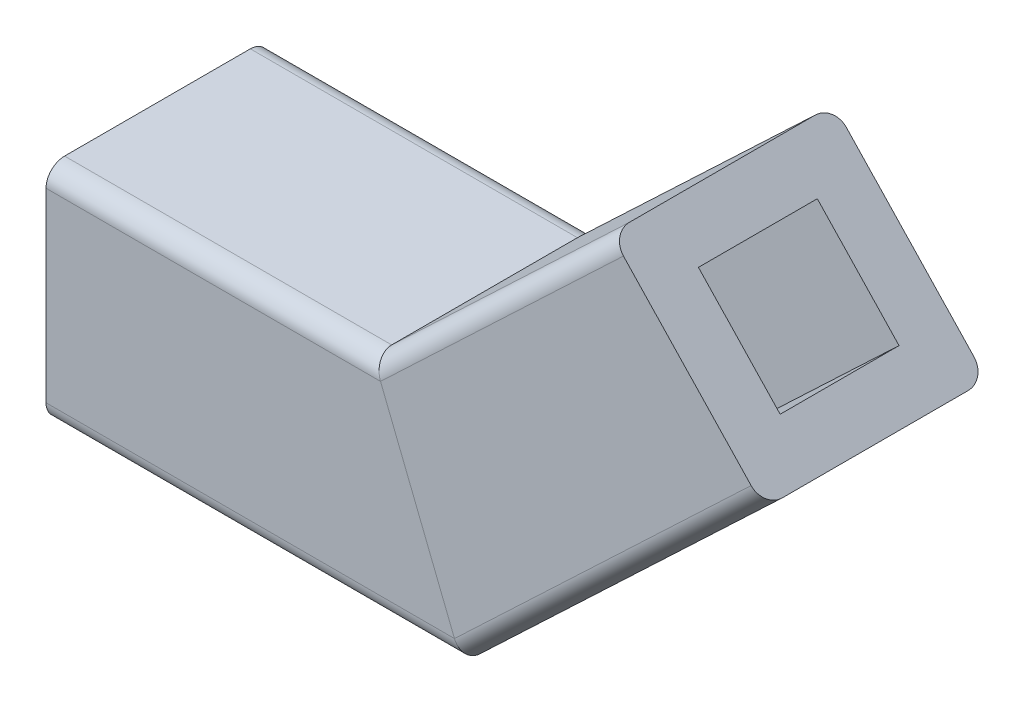
ISO-10303-21;
HEADER;
FILE_DESCRIPTION(('STEP AP214'),'2;1');
FILE_NAME('part.step','',(''),(''),'','','');
FILE_SCHEMA(('AUTOMOTIVE_DESIGN { 1 0 10303 214 1 1 1 1 }'));
ENDSEC;
DATA;
#1=APPLICATION_CONTEXT('core data for automotive mechanical design processes');
#2=APPLICATION_PROTOCOL_DEFINITION('international standard','automotive_design',2000,#1);
#3=PRODUCT_CONTEXT('',#1,'mechanical');
#4=PRODUCT('Part','Part','',(#3));
#5=PRODUCT_RELATED_PRODUCT_CATEGORY('part','',(#4));
#6=PRODUCT_DEFINITION_FORMATION('','',#4);
#7=PRODUCT_DEFINITION_CONTEXT('part definition',#1,'design');
#8=PRODUCT_DEFINITION('design','',#6,#7);
#9=PRODUCT_DEFINITION_SHAPE('','',#8);
#10=(LENGTH_UNIT() NAMED_UNIT(*) SI_UNIT(.MILLI.,.METRE.));
#11=(NAMED_UNIT(*) PLANE_ANGLE_UNIT() SI_UNIT($,.RADIAN.));
#12=(NAMED_UNIT(*) SI_UNIT($,.STERADIAN.) SOLID_ANGLE_UNIT());
#13=UNCERTAINTY_MEASURE_WITH_UNIT(LENGTH_MEASURE(1.E-05),#10,'distance_accuracy_value','');
#14=(GEOMETRIC_REPRESENTATION_CONTEXT(3) GLOBAL_UNCERTAINTY_ASSIGNED_CONTEXT((#13)) GLOBAL_UNIT_ASSIGNED_CONTEXT((#10,
#11,#12)) REPRESENTATION_CONTEXT('',''));
#15=CARTESIAN_POINT('',(0.,0.,0.));
#16=DIRECTION('',(0.,0.,1.));
#17=DIRECTION('',(1.,0.,0.));
#18=AXIS2_PLACEMENT_3D('',#15,#16,#17);
#19=CARTESIAN_POINT('',(11.0353685179918,-3.15088234105784,-3.));
#20=DIRECTION('',(0.,0.,-1.));
#21=DIRECTION('',(-1.,0.,0.));
#22=AXIS2_PLACEMENT_3D('',#19,#20,#21);
#23=PLANE('',#22);
#24=DIRECTION('',(-0.687467850210673,0.726214813210743,0.));
#25=VECTOR('',#24,1.);
#26=CARTESIAN_POINT('',(19.3245516827395,4.6960340624745,-3.));
#27=LINE('',#26,#25);
#28=CARTESIAN_POINT('',(18.9808177576341,5.05914146907988,-3.));
#29=VERTEX_POINT('',#28);
#30=CARTESIAN_POINT('',(15.5434785065807,8.69021553513359,-3.));
#31=VERTEX_POINT('',#30);
#32=EDGE_CURVE('E240',#29,#31,#27,.T.);
#33=ORIENTED_EDGE('',*,*,#32,.F.);
#34=DIRECTION('',(0.726214813210743,0.687467850210674,0.));
#35=VECTOR('',#34,1.);
#36=CARTESIAN_POINT('',(10.6916345928865,-2.78777493445247,-3.));
#37=LINE('',#36,#35);
#38=CARTESIAN_POINT('',(10.9956290563455,-2.5,-3.));
#39=VERTEX_POINT('',#38);
#40=EDGE_CURVE('E277',#29,#39,#37,.F.);
#41=ORIENTED_EDGE('',*,*,#40,.T.);
#42=DIRECTION('',(0.369989990938442,-0.929035740219595,0.));
#43=VECTOR('',#42,1.);
#44=CARTESIAN_POINT('',(9.66227584136973,0.848017031237252,-3.));
#45=LINE('',#44,#43);
#46=CARTESIAN_POINT('',(9.00437094365447,2.5,-3.));
#47=VERTEX_POINT('',#46);
#48=EDGE_CURVE('E256',#47,#39,#45,.T.);
#49=ORIENTED_EDGE('',*,*,#48,.F.);
#50=DIRECTION('',(0.726214813210743,0.687467850210674,0.));
#51=VECTOR('',#50,1.);
#52=CARTESIAN_POINT('',(7.25429534183311,0.843299131601245,-3.));
#53=LINE('',#52,#51);
#54=EDGE_CURVE('E274',#47,#31,#53,.T.);
#55=ORIENTED_EDGE('',*,*,#54,.T.);
#56=EDGE_LOOP('',(#33,#41,#49,#55));
#57=FACE_BOUND('',#56,.T.);
#58=ADVANCED_FACE('F41',(#57),#23,.T.);
#59=CARTESIAN_POINT('',(6.91056141672778,1.20640653820662,-3.));
#60=DIRECTION('',(-0.687467850210674,0.726214813210743,0.));
#61=DIRECTION('',(-0.726214813210743,-0.687467850210674,0.));
#62=AXIS2_PLACEMENT_3D('',#59,#60,#61);
#63=PLANE('',#62);
#64=DIRECTION('',(0.,0.,1.));
#65=VECTOR('',#64,1.);
#66=CARTESIAN_POINT('',(15.1997445814754,9.05332294173896,-3.));
#67=LINE('',#66,#65);
#68=CARTESIAN_POINT('',(15.1997445814754,9.05332294173896,-2.5));
#69=VERTEX_POINT('',#68);
#70=CARTESIAN_POINT('',(15.1997445814754,9.05332294173896,2.5));
#71=VERTEX_POINT('',#70);
#72=EDGE_CURVE('E237',#69,#71,#67,.T.);
#73=ORIENTED_EDGE('',*,*,#72,.F.);
#74=DIRECTION('',(0.726214813210743,0.687467850210674,0.));
#75=VECTOR('',#74,1.);
#76=CARTESIAN_POINT('',(6.91056141672778,1.20640653820662,-2.5));
#77=LINE('',#76,#75);
#78=CARTESIAN_POINT('',(8.80524513238537,3.,-2.5));
#79=VERTEX_POINT('',#78);
#80=EDGE_CURVE('E298',#69,#79,#77,.F.);
#81=ORIENTED_EDGE('',*,*,#80,.T.);
#82=DIRECTION('',(0.,0.,-1.));
#83=VECTOR('',#82,1.);
#84=CARTESIAN_POINT('',(8.80524513238537,3.,-3.));
#85=LINE('',#84,#83);
#86=CARTESIAN_POINT('',(8.80524513238537,3.,2.5));
#87=VERTEX_POINT('',#86);
#88=EDGE_CURVE('E248',#87,#79,#85,.T.);
#89=ORIENTED_EDGE('',*,*,#88,.F.);
#90=DIRECTION('',(0.726214813210743,0.687467850210674,0.));
#91=VECTOR('',#90,1.);
#92=CARTESIAN_POINT('',(6.91056141672778,1.20640653820661,2.5));
#93=LINE('',#92,#91);
#94=EDGE_CURVE('E295',#87,#71,#93,.T.);
#95=ORIENTED_EDGE('',*,*,#94,.T.);
#96=EDGE_LOOP('',(#73,#81,#89,#95));
#97=FACE_BOUND('',#96,.T.);
#98=ADVANCED_FACE('F345',(#97),#63,.T.);
#99=CARTESIAN_POINT('',(11.0353685179918,-3.15088234105785,3.));
#100=DIRECTION('',(0.,0.,1.));
#101=DIRECTION('',(1.,0.,0.));
#102=AXIS2_PLACEMENT_3D('',#99,#100,#101);
#103=PLANE('',#102);
#104=DIRECTION('',(-0.369989990938442,0.929035740219595,0.));
#105=VECTOR('',#104,1.);
#106=CARTESIAN_POINT('',(9.66227584136973,0.848017031237251,3.));
#107=LINE('',#106,#105);
#108=CARTESIAN_POINT('',(10.9956290563455,-2.5,3.));
#109=VERTEX_POINT('',#108);
#110=CARTESIAN_POINT('',(9.00437094365447,2.5,3.));
#111=VERTEX_POINT('',#110);
#112=EDGE_CURVE('E251',#109,#111,#107,.T.);
#113=ORIENTED_EDGE('',*,*,#112,.F.);
#114=DIRECTION('',(0.726214813210743,0.687467850210674,0.));
#115=VECTOR('',#114,1.);
#116=CARTESIAN_POINT('',(10.6916345928865,-2.78777493445247,3.));
#117=LINE('',#116,#115);
#118=CARTESIAN_POINT('',(18.9808177576341,5.05914146907987,3.));
#119=VERTEX_POINT('',#118);
#120=EDGE_CURVE('E305',#109,#119,#117,.T.);
#121=ORIENTED_EDGE('',*,*,#120,.T.);
#122=DIRECTION('',(0.687467850210673,-0.726214813210743,0.));
#123=VECTOR('',#122,1.);
#124=CARTESIAN_POINT('',(19.3245516827395,4.6960340624745,3.));
#125=LINE('',#124,#123);
#126=CARTESIAN_POINT('',(15.5434785065808,8.69021553513359,3.));
#127=VERTEX_POINT('',#126);
#128=EDGE_CURVE('E241',#127,#119,#125,.T.);
#129=ORIENTED_EDGE('',*,*,#128,.F.);
#130=DIRECTION('',(0.726214813210743,0.687467850210674,0.));
#131=VECTOR('',#130,1.);
#132=CARTESIAN_POINT('',(7.25429534183311,0.843299131601243,3.));
#133=LINE('',#132,#131);
#134=EDGE_CURVE('E58',#127,#111,#133,.F.);
#135=ORIENTED_EDGE('',*,*,#134,.T.);
#136=EDGE_LOOP('',(#113,#121,#129,#135));
#137=FACE_BOUND('',#136,.T.);
#138=ADVANCED_FACE('F338',(#137),#103,.T.);
#139=CARTESIAN_POINT('',(11.0353685179918,-3.15088234105784,-3.));
#140=DIRECTION('',(0.687467850210674,-0.726214813210743,0.));
#141=DIRECTION('',(0.726214813210743,0.687467850210674,0.));
#142=AXIS2_PLACEMENT_3D('',#139,#140,#141);
#143=PLANE('',#142);
#144=DIRECTION('',(0.,0.,1.));
#145=VECTOR('',#144,1.);
#146=CARTESIAN_POINT('',(11.1947548676146,-3.,-3.));
#147=LINE('',#146,#145);
#148=CARTESIAN_POINT('',(11.1947548676146,-3.,-2.5));
#149=VERTEX_POINT('',#148);
#150=CARTESIAN_POINT('',(11.1947548676146,-3.,2.5));
#151=VERTEX_POINT('',#150);
#152=EDGE_CURVE('E253',#149,#151,#147,.T.);
#153=ORIENTED_EDGE('',*,*,#152,.F.);
#154=DIRECTION('',(0.726214813210743,0.687467850210674,0.));
#155=VECTOR('',#154,1.);
#156=CARTESIAN_POINT('',(11.0353685179918,-3.15088234105784,-2.5));
#157=LINE('',#156,#155);
#158=CARTESIAN_POINT('',(19.3245516827395,4.6960340624745,-2.5));
#159=VERTEX_POINT('',#158);
#160=EDGE_CURVE('E262',#149,#159,#157,.T.);
#161=ORIENTED_EDGE('',*,*,#160,.T.);
#162=DIRECTION('',(0.,0.,-1.));
#163=VECTOR('',#162,1.);
#164=CARTESIAN_POINT('',(19.3245516827395,4.6960340624745,-3.));
#165=LINE('',#164,#163);
#166=CARTESIAN_POINT('',(19.3245516827395,4.6960340624745,2.5));
#167=VERTEX_POINT('',#166);
#168=EDGE_CURVE('E236',#167,#159,#165,.T.);
#169=ORIENTED_EDGE('',*,*,#168,.F.);
#170=DIRECTION('',(0.726214813210743,0.687467850210674,0.));
#171=VECTOR('',#170,1.);
#172=CARTESIAN_POINT('',(11.0353685179918,-3.15088234105785,2.5));
#173=LINE('',#172,#171);
#174=EDGE_CURVE('E260',#167,#151,#173,.F.);
#175=ORIENTED_EDGE('',*,*,#174,.T.);
#176=EDGE_LOOP('',(#153,#161,#169,#175));
#177=FACE_BOUND('',#176,.T.);
#178=ADVANCED_FACE('F367',(#177),#143,.T.);
#179=CARTESIAN_POINT('',(0.,-3.,-3.));
#180=DIRECTION('',(0.,-1.,0.));
#181=DIRECTION('',(0.,0.,-1.));
#182=AXIS2_PLACEMENT_3D('',#179,#180,#181);
#183=PLANE('',#182);
#184=DIRECTION('',(0.,0.,-1.));
#185=VECTOR('',#184,1.);
#186=CARTESIAN_POINT('',(0.,-3.,-3.));
#187=LINE('',#186,#185);
#188=CARTESIAN_POINT('',(0.,-3.,2.5));
#189=VERTEX_POINT('',#188);
#190=CARTESIAN_POINT('',(0.,-3.,-2.5));
#191=VERTEX_POINT('',#190);
#192=EDGE_CURVE('E209',#189,#191,#187,.T.);
#193=ORIENTED_EDGE('',*,*,#192,.T.);
#194=DIRECTION('',(1.,0.,0.));
#195=VECTOR('',#194,1.);
#196=CARTESIAN_POINT('',(0.,-3.,-2.5));
#197=LINE('',#196,#195);
#198=EDGE_CURVE('E281',#191,#149,#197,.T.);
#199=ORIENTED_EDGE('',*,*,#198,.T.);
#200=ORIENTED_EDGE('',*,*,#152,.T.);
#201=DIRECTION('',(1.,0.,0.));
#202=VECTOR('',#201,1.);
#203=CARTESIAN_POINT('',(0.,-3.,2.5));
#204=LINE('',#203,#202);
#205=EDGE_CURVE('E279',#151,#189,#204,.F.);
#206=ORIENTED_EDGE('',*,*,#205,.T.);
#207=EDGE_LOOP('',(#193,#199,#200,#206));
#208=FACE_BOUND('',#207,.T.);
#209=ADVANCED_FACE('F377',(#208),#183,.T.);
#210=CARTESIAN_POINT('',(0.,-3.,3.));
#211=DIRECTION('',(0.,0.,1.));
#212=DIRECTION('',(1.,0.,0.));
#213=AXIS2_PLACEMENT_3D('',#210,#211,#212);
#214=PLANE('',#213);
#215=DIRECTION('',(0.,-1.,0.));
#216=VECTOR('',#215,1.);
#217=CARTESIAN_POINT('',(0.,-3.,3.));
#218=LINE('',#217,#216);
#219=CARTESIAN_POINT('',(0.,2.5,3.));
#220=VERTEX_POINT('',#219);
#221=CARTESIAN_POINT('',(0.,-2.5,3.));
#222=VERTEX_POINT('',#221);
#223=EDGE_CURVE('E230',#220,#222,#218,.T.);
#224=ORIENTED_EDGE('',*,*,#223,.T.);
#225=DIRECTION('',(1.,0.,0.));
#226=VECTOR('',#225,1.);
#227=CARTESIAN_POINT('',(0.,-2.5,3.));
#228=LINE('',#227,#226);
#229=EDGE_CURVE('E11',#222,#109,#228,.T.);
#230=ORIENTED_EDGE('',*,*,#229,.T.);
#231=ORIENTED_EDGE('',*,*,#112,.T.);
#232=DIRECTION('',(1.,0.,0.));
#233=VECTOR('',#232,1.);
#234=CARTESIAN_POINT('',(0.,2.5,3.));
#235=LINE('',#234,#233);
#236=EDGE_CURVE('E50',#111,#220,#235,.F.);
#237=ORIENTED_EDGE('',*,*,#236,.T.);
#238=EDGE_LOOP('',(#224,#230,#231,#237));
#239=FACE_BOUND('',#238,.T.);
#240=ADVANCED_FACE('F329',(#239),#214,.T.);
#241=CARTESIAN_POINT('',(0.,3.,-3.));
#242=DIRECTION('',(0.,1.,0.));
#243=DIRECTION('',(0.,0.,1.));
#244=AXIS2_PLACEMENT_3D('',#241,#242,#243);
#245=PLANE('',#244);
#246=ORIENTED_EDGE('',*,*,#88,.T.);
#247=DIRECTION('',(1.,0.,0.));
#248=VECTOR('',#247,1.);
#249=CARTESIAN_POINT('',(0.,3.,-2.5));
#250=LINE('',#249,#248);
#251=CARTESIAN_POINT('',(0.,3.,-2.5));
#252=VERTEX_POINT('',#251);
#253=EDGE_CURVE('E302',#79,#252,#250,.F.);
#254=ORIENTED_EDGE('',*,*,#253,.T.);
#255=DIRECTION('',(0.,0.,1.));
#256=VECTOR('',#255,1.);
#257=CARTESIAN_POINT('',(0.,3.,-3.));
#258=LINE('',#257,#256);
#259=CARTESIAN_POINT('',(0.,3.,2.5));
#260=VERTEX_POINT('',#259);
#261=EDGE_CURVE('E226',#252,#260,#258,.T.);
#262=ORIENTED_EDGE('',*,*,#261,.T.);
#263=DIRECTION('',(1.,0.,0.));
#264=VECTOR('',#263,1.);
#265=CARTESIAN_POINT('',(0.,3.,2.5));
#266=LINE('',#265,#264);
#267=EDGE_CURVE('E300',#260,#87,#266,.T.);
#268=ORIENTED_EDGE('',*,*,#267,.T.);
#269=EDGE_LOOP('',(#246,#254,#262,#268));
#270=FACE_BOUND('',#269,.T.);
#271=ADVANCED_FACE('F349',(#270),#245,.T.);
#272=CARTESIAN_POINT('',(0.,-3.,-3.));
#273=DIRECTION('',(0.,0.,-1.));
#274=DIRECTION('',(-1.,0.,0.));
#275=AXIS2_PLACEMENT_3D('',#272,#273,#274);
#276=PLANE('',#275);
#277=ORIENTED_EDGE('',*,*,#48,.T.);
#278=DIRECTION('',(1.,0.,0.));
#279=VECTOR('',#278,1.);
#280=CARTESIAN_POINT('',(0.,-2.5,-3.));
#281=LINE('',#280,#279);
#282=CARTESIAN_POINT('',(0.,-2.5,-3.));
#283=VERTEX_POINT('',#282);
#284=EDGE_CURVE('E285',#39,#283,#281,.F.);
#285=ORIENTED_EDGE('',*,*,#284,.T.);
#286=DIRECTION('',(0.,1.,0.));
#287=VECTOR('',#286,1.);
#288=CARTESIAN_POINT('',(0.,-3.,-3.));
#289=LINE('',#288,#287);
#290=CARTESIAN_POINT('',(0.,2.5,-3.));
#291=VERTEX_POINT('',#290);
#292=EDGE_CURVE('E229',#283,#291,#289,.T.);
#293=ORIENTED_EDGE('',*,*,#292,.T.);
#294=DIRECTION('',(1.,0.,0.));
#295=VECTOR('',#294,1.);
#296=CARTESIAN_POINT('',(0.,2.5,-3.));
#297=LINE('',#296,#295);
#298=EDGE_CURVE('E283',#291,#47,#297,.T.);
#299=ORIENTED_EDGE('',*,*,#298,.T.);
#300=EDGE_LOOP('',(#277,#285,#293,#299));
#301=FACE_BOUND('',#300,.T.);
#302=ADVANCED_FACE('F376',(#301),#276,.T.);
#303=CARTESIAN_POINT('',(17.2621481321074,6.87467850210673,0.));
#304=DIRECTION('',(0.726214813210743,0.687467850210673,0.));
#305=DIRECTION('',(0.,0.,-1.));
#306=AXIS2_PLACEMENT_3D('',#303,#304,#305);
#307=PLANE('',#306);
#308=DIRECTION('',(-0.687467850210673,0.726214813210743,0.));
#309=VECTOR('',#308,1.);
#310=CARTESIAN_POINT('',(18.3620966924445,5.71273480096954,-1.6));
#311=LINE('',#310,#309);
#312=CARTESIAN_POINT('',(16.1621995717704,8.03662220324392,-1.6));
#313=VERTEX_POINT('',#312);
#314=CARTESIAN_POINT('',(18.3620966924445,5.71273480096955,-1.6));
#315=VERTEX_POINT('',#314);
#316=EDGE_CURVE('E206',#313,#315,#311,.F.);
#317=ORIENTED_EDGE('',*,*,#316,.T.);
#318=DIRECTION('',(0.,0.,-1.));
#319=VECTOR('',#318,1.);
#320=CARTESIAN_POINT('',(18.3620966924445,5.71273480096954,1.6));
#321=LINE('',#320,#319);
#322=CARTESIAN_POINT('',(18.3620966924445,5.71273480096955,1.6));
#323=VERTEX_POINT('',#322);
#324=EDGE_CURVE('E213',#315,#323,#321,.F.);
#325=ORIENTED_EDGE('',*,*,#324,.T.);
#326=DIRECTION('',(0.687467850210673,-0.726214813210743,0.));
#327=VECTOR('',#326,1.);
#328=CARTESIAN_POINT('',(18.3620966924445,5.71273480096954,1.6));
#329=LINE('',#328,#327);
#330=CARTESIAN_POINT('',(16.1621995717704,8.03662220324392,1.6));
#331=VERTEX_POINT('',#330);
#332=EDGE_CURVE('E211',#323,#331,#329,.F.);
#333=ORIENTED_EDGE('',*,*,#332,.T.);
#334=DIRECTION('',(0.,0.,1.));
#335=VECTOR('',#334,1.);
#336=CARTESIAN_POINT('',(16.1621995717704,8.03662220324392,1.6));
#337=LINE('',#336,#335);
#338=EDGE_CURVE('E208',#331,#313,#337,.F.);
#339=ORIENTED_EDGE('',*,*,#338,.T.);
#340=EDGE_LOOP('',(#317,#325,#333,#339));
#341=FACE_BOUND('',#340,.T.);
#342=ORIENTED_EDGE('',*,*,#168,.T.);
#343=CARTESIAN_POINT('',(18.9808177576341,5.05914146907988,-2.5));
#344=DIRECTION('',(0.726214813210743,0.687467850210673,0.));
#345=DIRECTION('',(-0.687467850210673,0.726214813210743,0.));
#346=AXIS2_PLACEMENT_3D('',#343,#344,#345);
#347=CIRCLE('',#346,0.5);
#348=EDGE_CURVE('E272',#159,#29,#347,.T.);
#349=ORIENTED_EDGE('',*,*,#348,.T.);
#350=ORIENTED_EDGE('',*,*,#32,.T.);
#351=CARTESIAN_POINT('',(15.5434785065808,8.69021553513359,-2.5));
#352=DIRECTION('',(0.726214813210743,0.687467850210673,0.));
#353=DIRECTION('',(-0.687467850210673,0.726214813210743,0.));
#354=AXIS2_PLACEMENT_3D('',#351,#352,#353);
#355=CIRCLE('',#354,0.5);
#356=EDGE_CURVE('E270',#31,#69,#355,.T.);
#357=ORIENTED_EDGE('',*,*,#356,.T.);
#358=ORIENTED_EDGE('',*,*,#72,.T.);
#359=CARTESIAN_POINT('',(15.5434785065808,8.69021553513359,2.5));
#360=DIRECTION('',(0.726214813210743,0.687467850210673,0.));
#361=DIRECTION('',(-0.687467850210673,0.726214813210743,0.));
#362=AXIS2_PLACEMENT_3D('',#359,#360,#361);
#363=CIRCLE('',#362,0.5);
#364=EDGE_CURVE('E266',#71,#127,#363,.T.);
#365=ORIENTED_EDGE('',*,*,#364,.T.);
#366=ORIENTED_EDGE('',*,*,#128,.T.);
#367=CARTESIAN_POINT('',(18.9808177576341,5.05914146907987,2.5));
#368=DIRECTION('',(0.726214813210743,0.687467850210673,0.));
#369=DIRECTION('',(-0.687467850210673,0.726214813210743,0.));
#370=AXIS2_PLACEMENT_3D('',#367,#368,#369);
#371=CIRCLE('',#370,0.5);
#372=EDGE_CURVE('E268',#119,#167,#371,.T.);
#373=ORIENTED_EDGE('',*,*,#372,.T.);
#374=EDGE_LOOP('',(#342,#349,#350,#357,#358,#365,#366,#373));
#375=FACE_BOUND('',#374,.T.);
#376=ADVANCED_FACE('F340',(#341,#375),#307,.T.);
#377=CARTESIAN_POINT('',(0.,0.,0.));
#378=DIRECTION('',(1.,0.,0.));
#379=DIRECTION('',(0.,0.,-1.));
#380=AXIS2_PLACEMENT_3D('',#377,#378,#379);
#381=PLANE('',#380);
#382=DIRECTION('',(0.,1.,0.));
#383=VECTOR('',#382,1.);
#384=CARTESIAN_POINT('',(0.,-1.6,-1.6));
#385=LINE('',#384,#383);
#386=CARTESIAN_POINT('',(0.,1.6,-1.6));
#387=VERTEX_POINT('',#386);
#388=CARTESIAN_POINT('',(0.,-1.6,-1.6));
#389=VERTEX_POINT('',#388);
#390=EDGE_CURVE('E171',#387,#389,#385,.F.);
#391=ORIENTED_EDGE('',*,*,#390,.F.);
#392=DIRECTION('',(0.,0.,1.));
#393=VECTOR('',#392,1.);
#394=CARTESIAN_POINT('',(0.,1.6,1.6));
#395=LINE('',#394,#393);
#396=CARTESIAN_POINT('',(0.,1.6,1.6));
#397=VERTEX_POINT('',#396);
#398=EDGE_CURVE('E189',#397,#387,#395,.F.);
#399=ORIENTED_EDGE('',*,*,#398,.F.);
#400=DIRECTION('',(0.,-1.,0.));
#401=VECTOR('',#400,1.);
#402=CARTESIAN_POINT('',(0.,-1.6,1.6));
#403=LINE('',#402,#401);
#404=CARTESIAN_POINT('',(0.,-1.6,1.6));
#405=VERTEX_POINT('',#404);
#406=EDGE_CURVE('E174',#405,#397,#403,.F.);
#407=ORIENTED_EDGE('',*,*,#406,.F.);
#408=DIRECTION('',(0.,0.,-1.));
#409=VECTOR('',#408,1.);
#410=CARTESIAN_POINT('',(0.,-1.6,1.6));
#411=LINE('',#410,#409);
#412=EDGE_CURVE('E167',#389,#405,#411,.F.);
#413=ORIENTED_EDGE('',*,*,#412,.F.);
#414=EDGE_LOOP('',(#391,#399,#407,#413));
#415=FACE_BOUND('',#414,.T.);
#416=ORIENTED_EDGE('',*,*,#292,.F.);
#417=CARTESIAN_POINT('',(0.,-2.5,-2.5));
#418=DIRECTION('',(1.,0.,0.));
#419=DIRECTION('',(0.,0.,-1.));
#420=AXIS2_PLACEMENT_3D('',#417,#418,#419);
#421=CIRCLE('',#420,0.5);
#422=EDGE_CURVE('E293',#283,#191,#421,.F.);
#423=ORIENTED_EDGE('',*,*,#422,.T.);
#424=ORIENTED_EDGE('',*,*,#192,.F.);
#425=CARTESIAN_POINT('',(0.,-2.5,2.5));
#426=DIRECTION('',(1.,0.,0.));
#427=DIRECTION('',(0.,0.,-1.));
#428=AXIS2_PLACEMENT_3D('',#425,#426,#427);
#429=CIRCLE('',#428,0.5);
#430=EDGE_CURVE('E289',#189,#222,#429,.F.);
#431=ORIENTED_EDGE('',*,*,#430,.T.);
#432=ORIENTED_EDGE('',*,*,#223,.F.);
#433=CARTESIAN_POINT('',(0.,2.5,2.5));
#434=DIRECTION('',(1.,0.,0.));
#435=DIRECTION('',(0.,0.,-1.));
#436=AXIS2_PLACEMENT_3D('',#433,#434,#435);
#437=CIRCLE('',#436,0.5);
#438=EDGE_CURVE('E287',#220,#260,#437,.F.);
#439=ORIENTED_EDGE('',*,*,#438,.T.);
#440=ORIENTED_EDGE('',*,*,#261,.F.);
#441=CARTESIAN_POINT('',(0.,2.5,-2.5));
#442=DIRECTION('',(1.,0.,0.));
#443=DIRECTION('',(0.,0.,-1.));
#444=AXIS2_PLACEMENT_3D('',#441,#442,#443);
#445=CIRCLE('',#444,0.5);
#446=EDGE_CURVE('E291',#252,#291,#445,.F.);
#447=ORIENTED_EDGE('',*,*,#446,.T.);
#448=EDGE_LOOP('',(#416,#423,#424,#431,#432,#439,#440,#447));
#449=FACE_BOUND('',#448,.T.);
#450=ADVANCED_FACE('F169',(#415,#449),#381,.F.);
#451=CARTESIAN_POINT('',(10.5183065183125,-1.71255241490735,1.6));
#452=DIRECTION('',(-0.687467850210673,0.726214813210743,0.));
#453=DIRECTION('',(-0.726214813210743,-0.687467850210674,0.));
#454=AXIS2_PLACEMENT_3D('',#451,#452,#453);
#455=PLANE('',#454);
#456=DIRECTION('',(0.,0.,-1.));
#457=VECTOR('',#456,1.);
#458=CARTESIAN_POINT('',(10.6372025960611,-1.6,1.6));
#459=LINE('',#458,#457);
#460=CARTESIAN_POINT('',(10.6372025960611,-1.6,1.6));
#461=VERTEX_POINT('',#460);
#462=CARTESIAN_POINT('',(10.6372025960611,-1.6,-1.6));
#463=VERTEX_POINT('',#462);
#464=EDGE_CURVE('E193',#461,#463,#459,.T.);
#465=ORIENTED_EDGE('',*,*,#464,.F.);
#466=DIRECTION('',(0.726214813210743,0.687467850210673,0.));
#467=VECTOR('',#466,1.);
#468=CARTESIAN_POINT('',(10.5183065183125,-1.71255241490735,1.6));
#469=LINE('',#468,#467);
#470=EDGE_CURVE('E221',#461,#323,#469,.T.);
#471=ORIENTED_EDGE('',*,*,#470,.T.);
#472=ORIENTED_EDGE('',*,*,#324,.F.);
#473=DIRECTION('',(0.726214813210743,0.687467850210673,0.));
#474=VECTOR('',#473,1.);
#475=CARTESIAN_POINT('',(10.5183065183125,-1.71255241490735,-1.6));
#476=LINE('',#475,#474);
#477=EDGE_CURVE('E179',#463,#315,#476,.T.);
#478=ORIENTED_EDGE('',*,*,#477,.F.);
#479=EDGE_LOOP('',(#465,#471,#472,#478));
#480=FACE_BOUND('',#479,.T.);
#481=ADVANCED_FACE('F406',(#480),#455,.T.);
#482=CARTESIAN_POINT('',(10.5183065183125,-1.71255241490735,1.6));
#483=DIRECTION('',(0.,0.,-1.));
#484=DIRECTION('',(-1.,0.,0.));
#485=AXIS2_PLACEMENT_3D('',#482,#483,#484);
#486=PLANE('',#485);
#487=DIRECTION('',(0.369989990938442,-0.929035740219595,0.));
#488=VECTOR('',#487,1.);
#489=CARTESIAN_POINT('',(9.18104834622226,2.05636740048477,1.6));
#490=LINE('',#489,#488);
#491=CARTESIAN_POINT('',(9.36279740393886,1.6,1.6));
#492=VERTEX_POINT('',#491);
#493=EDGE_CURVE('E263',#492,#461,#490,.T.);
#494=ORIENTED_EDGE('',*,*,#493,.F.);
#495=DIRECTION('',(0.726214813210743,0.687467850210673,0.));
#496=VECTOR('',#495,1.);
#497=CARTESIAN_POINT('',(8.31840939763831,0.611334987367031,1.6));
#498=LINE('',#497,#496);
#499=EDGE_CURVE('E218',#492,#331,#498,.T.);
#500=ORIENTED_EDGE('',*,*,#499,.T.);
#501=ORIENTED_EDGE('',*,*,#332,.F.);
#502=ORIENTED_EDGE('',*,*,#470,.F.);
#503=EDGE_LOOP('',(#494,#500,#501,#502));
#504=FACE_BOUND('',#503,.T.);
#505=ADVANCED_FACE('F409',(#504),#486,.T.);
#506=CARTESIAN_POINT('',(8.31840939763831,0.611334987367031,1.6));
#507=DIRECTION('',(0.687467850210673,-0.726214813210743,0.));
#508=DIRECTION('',(0.726214813210743,0.687467850210674,0.));
#509=AXIS2_PLACEMENT_3D('',#506,#507,#508);
#510=PLANE('',#509);
#511=DIRECTION('',(0.,0.,1.));
#512=VECTOR('',#511,1.);
#513=CARTESIAN_POINT('',(9.36279740393886,1.6,1.6));
#514=LINE('',#513,#512);
#515=CARTESIAN_POINT('',(9.36279740393886,1.6,-1.6));
#516=VERTEX_POINT('',#515);
#517=EDGE_CURVE('E604',#516,#492,#514,.T.);
#518=ORIENTED_EDGE('',*,*,#517,.F.);
#519=DIRECTION('',(0.726214813210743,0.687467850210673,0.));
#520=VECTOR('',#519,1.);
#521=CARTESIAN_POINT('',(8.31840939763831,0.611334987367031,-1.6));
#522=LINE('',#521,#520);
#523=EDGE_CURVE('E215',#516,#313,#522,.T.);
#524=ORIENTED_EDGE('',*,*,#523,.T.);
#525=ORIENTED_EDGE('',*,*,#338,.F.);
#526=ORIENTED_EDGE('',*,*,#499,.F.);
#527=EDGE_LOOP('',(#518,#524,#525,#526));
#528=FACE_BOUND('',#527,.T.);
#529=ADVANCED_FACE('F413',(#528),#510,.T.);
#530=CARTESIAN_POINT('',(10.5183065183125,-1.71255241490735,-1.6));
#531=DIRECTION('',(0.,0.,1.));
#532=DIRECTION('',(1.,0.,0.));
#533=AXIS2_PLACEMENT_3D('',#530,#531,#532);
#534=PLANE('',#533);
#535=DIRECTION('',(-0.369989990938442,0.929035740219595,0.));
#536=VECTOR('',#535,1.);
#537=CARTESIAN_POINT('',(9.18104834622226,2.05636740048477,-1.6));
#538=LINE('',#537,#536);
#539=EDGE_CURVE('E205',#463,#516,#538,.T.);
#540=ORIENTED_EDGE('',*,*,#539,.F.);
#541=ORIENTED_EDGE('',*,*,#477,.T.);
#542=ORIENTED_EDGE('',*,*,#316,.F.);
#543=ORIENTED_EDGE('',*,*,#523,.F.);
#544=EDGE_LOOP('',(#540,#541,#542,#543));
#545=FACE_BOUND('',#544,.T.);
#546=ADVANCED_FACE('F405',(#545),#534,.T.);
#547=CARTESIAN_POINT('',(0.,-1.6,-1.6));
#548=DIRECTION('',(0.,0.,1.));
#549=DIRECTION('',(1.,0.,0.));
#550=AXIS2_PLACEMENT_3D('',#547,#548,#549);
#551=PLANE('',#550);
#552=DIRECTION('',(1.,0.,0.));
#553=VECTOR('',#552,1.);
#554=CARTESIAN_POINT('',(0.,-1.6,-1.6));
#555=LINE('',#554,#553);
#556=EDGE_CURVE('E186',#389,#463,#555,.T.);
#557=ORIENTED_EDGE('',*,*,#556,.T.);
#558=ORIENTED_EDGE('',*,*,#539,.T.);
#559=DIRECTION('',(1.,0.,0.));
#560=VECTOR('',#559,1.);
#561=CARTESIAN_POINT('',(0.,1.6,-1.6));
#562=LINE('',#561,#560);
#563=EDGE_CURVE('E188',#387,#516,#562,.T.);
#564=ORIENTED_EDGE('',*,*,#563,.F.);
#565=ORIENTED_EDGE('',*,*,#390,.T.);
#566=EDGE_LOOP('',(#557,#558,#564,#565));
#567=FACE_BOUND('',#566,.T.);
#568=ADVANCED_FACE('F184',(#567),#551,.T.);
#569=CARTESIAN_POINT('',(0.,1.6,1.6));
#570=DIRECTION('',(0.,-1.,0.));
#571=DIRECTION('',(0.,0.,-1.));
#572=AXIS2_PLACEMENT_3D('',#569,#570,#571);
#573=PLANE('',#572);
#574=ORIENTED_EDGE('',*,*,#563,.T.);
#575=ORIENTED_EDGE('',*,*,#517,.T.);
#576=DIRECTION('',(1.,0.,0.));
#577=VECTOR('',#576,1.);
#578=CARTESIAN_POINT('',(0.,1.6,1.6));
#579=LINE('',#578,#577);
#580=EDGE_CURVE('E196',#397,#492,#579,.T.);
#581=ORIENTED_EDGE('',*,*,#580,.F.);
#582=ORIENTED_EDGE('',*,*,#398,.T.);
#583=EDGE_LOOP('',(#574,#575,#581,#582));
#584=FACE_BOUND('',#583,.T.);
#585=ADVANCED_FACE('F396',(#584),#573,.T.);
#586=CARTESIAN_POINT('',(0.,-1.6,1.6));
#587=DIRECTION('',(0.,0.,-1.));
#588=DIRECTION('',(-1.,0.,0.));
#589=AXIS2_PLACEMENT_3D('',#586,#587,#588);
#590=PLANE('',#589);
#591=ORIENTED_EDGE('',*,*,#580,.T.);
#592=ORIENTED_EDGE('',*,*,#493,.T.);
#593=DIRECTION('',(1.,0.,0.));
#594=VECTOR('',#593,1.);
#595=CARTESIAN_POINT('',(0.,-1.6,1.6));
#596=LINE('',#595,#594);
#597=EDGE_CURVE('E194',#405,#461,#596,.T.);
#598=ORIENTED_EDGE('',*,*,#597,.F.);
#599=ORIENTED_EDGE('',*,*,#406,.T.);
#600=EDGE_LOOP('',(#591,#592,#598,#599));
#601=FACE_BOUND('',#600,.T.);
#602=ADVANCED_FACE('F388',(#601),#590,.T.);
#603=CARTESIAN_POINT('',(0.,-1.6,1.6));
#604=DIRECTION('',(0.,1.,0.));
#605=DIRECTION('',(0.,0.,1.));
#606=AXIS2_PLACEMENT_3D('',#603,#604,#605);
#607=PLANE('',#606);
#608=ORIENTED_EDGE('',*,*,#597,.T.);
#609=ORIENTED_EDGE('',*,*,#464,.T.);
#610=ORIENTED_EDGE('',*,*,#556,.F.);
#611=ORIENTED_EDGE('',*,*,#412,.T.);
#612=EDGE_LOOP('',(#608,#609,#610,#611));
#613=FACE_BOUND('',#612,.T.);
#614=ADVANCED_FACE('F192',(#613),#607,.T.);
#615=CARTESIAN_POINT('',(0.,-2.5,-2.5));
#616=DIRECTION('',(1.,0.,0.));
#617=DIRECTION('',(0.,0.,-1.));
#618=AXIS2_PLACEMENT_3D('',#615,#616,#617);
#619=CYLINDRICAL_SURFACE('',#618,0.5);
#620=ORIENTED_EDGE('',*,*,#422,.F.);
#621=ORIENTED_EDGE('',*,*,#284,.F.);
#622=CARTESIAN_POINT('',(10.9956290563455,-2.5,-2.5));
#623=DIRECTION('',(0.929035740219595,0.369989990938442,0.));
#624=DIRECTION('',(0.369989990938442,-0.929035740219596,0.));
#625=AXIS2_PLACEMENT_3D('',#622,#623,#624);
#626=ELLIPSE('',#625,0.538192427216864,0.5);
#627=EDGE_CURVE('E259',#149,#39,#626,.T.);
#628=ORIENTED_EDGE('',*,*,#627,.F.);
#629=ORIENTED_EDGE('',*,*,#198,.F.);
#630=EDGE_LOOP('',(#620,#621,#628,#629));
#631=FACE_BOUND('',#630,.T.);
#632=ADVANCED_FACE('F374',(#631),#619,.T.);
#633=CARTESIAN_POINT('',(10.6916345928865,-2.78777493445247,-2.5));
#634=DIRECTION('',(0.726214813210743,0.687467850210674,0.));
#635=DIRECTION('',(-0.687467850210674,0.726214813210743,0.));
#636=AXIS2_PLACEMENT_3D('',#633,#634,#635);
#637=CYLINDRICAL_SURFACE('',#636,0.5);
#638=ORIENTED_EDGE('',*,*,#627,.T.);
#639=ORIENTED_EDGE('',*,*,#40,.F.);
#640=ORIENTED_EDGE('',*,*,#348,.F.);
#641=ORIENTED_EDGE('',*,*,#160,.F.);
#642=EDGE_LOOP('',(#638,#639,#640,#641));
#643=FACE_BOUND('',#642,.T.);
#644=ADVANCED_FACE('F364',(#643),#637,.T.);
#645=CARTESIAN_POINT('',(0.,2.5,-2.5));
#646=DIRECTION('',(1.,0.,0.));
#647=DIRECTION('',(0.,0.,-1.));
#648=AXIS2_PLACEMENT_3D('',#645,#646,#647);
#649=CYLINDRICAL_SURFACE('',#648,0.5);
#650=ORIENTED_EDGE('',*,*,#446,.F.);
#651=ORIENTED_EDGE('',*,*,#253,.F.);
#652=CARTESIAN_POINT('',(9.00437094365447,2.5,-2.5));
#653=DIRECTION('',(0.929035740219595,0.369989990938442,0.));
#654=DIRECTION('',(-0.369989990938442,0.929035740219596,0.));
#655=AXIS2_PLACEMENT_3D('',#652,#653,#654);
#656=ELLIPSE('',#655,0.538192427216864,0.5);
#657=EDGE_CURVE('E311',#47,#79,#656,.T.);
#658=ORIENTED_EDGE('',*,*,#657,.F.);
#659=ORIENTED_EDGE('',*,*,#298,.F.);
#660=EDGE_LOOP('',(#650,#651,#658,#659));
#661=FACE_BOUND('',#660,.T.);
#662=ADVANCED_FACE('F353',(#661),#649,.T.);
#663=CARTESIAN_POINT('',(7.25429534183311,0.843299131601243,-2.5));
#664=DIRECTION('',(0.726214813210743,0.687467850210674,0.));
#665=DIRECTION('',(-0.687467850210674,0.726214813210743,0.));
#666=AXIS2_PLACEMENT_3D('',#663,#664,#665);
#667=CYLINDRICAL_SURFACE('',#666,0.5);
#668=ORIENTED_EDGE('',*,*,#657,.T.);
#669=ORIENTED_EDGE('',*,*,#80,.F.);
#670=ORIENTED_EDGE('',*,*,#356,.F.);
#671=ORIENTED_EDGE('',*,*,#54,.F.);
#672=EDGE_LOOP('',(#668,#669,#670,#671));
#673=FACE_BOUND('',#672,.T.);
#674=ADVANCED_FACE('F357',(#673),#667,.T.);
#675=CARTESIAN_POINT('',(0.,-2.5,2.5));
#676=DIRECTION('',(1.,0.,0.));
#677=DIRECTION('',(0.,0.,-1.));
#678=AXIS2_PLACEMENT_3D('',#675,#676,#677);
#679=CYLINDRICAL_SURFACE('',#678,0.5);
#680=ORIENTED_EDGE('',*,*,#430,.F.);
#681=ORIENTED_EDGE('',*,*,#205,.F.);
#682=CARTESIAN_POINT('',(10.9956290563455,-2.5,2.5));
#683=DIRECTION('',(0.929035740219595,0.369989990938442,0.));
#684=DIRECTION('',(0.369989990938442,-0.929035740219596,0.));
#685=AXIS2_PLACEMENT_3D('',#682,#683,#684);
#686=ELLIPSE('',#685,0.538192427216864,0.5);
#687=EDGE_CURVE('E313',#109,#151,#686,.T.);
#688=ORIENTED_EDGE('',*,*,#687,.F.);
#689=ORIENTED_EDGE('',*,*,#229,.F.);
#690=EDGE_LOOP('',(#680,#681,#688,#689));
#691=FACE_BOUND('',#690,.T.);
#692=ADVANCED_FACE('F336',(#691),#679,.T.);
#693=CARTESIAN_POINT('',(10.6916345928865,-2.78777493445247,2.5));
#694=DIRECTION('',(0.726214813210743,0.687467850210674,0.));
#695=DIRECTION('',(-0.687467850210674,0.726214813210743,0.));
#696=AXIS2_PLACEMENT_3D('',#693,#694,#695);
#697=CYLINDRICAL_SURFACE('',#696,0.5);
#698=ORIENTED_EDGE('',*,*,#687,.T.);
#699=ORIENTED_EDGE('',*,*,#174,.F.);
#700=ORIENTED_EDGE('',*,*,#372,.F.);
#701=ORIENTED_EDGE('',*,*,#120,.F.);
#702=EDGE_LOOP('',(#698,#699,#700,#701));
#703=FACE_BOUND('',#702,.T.);
#704=ADVANCED_FACE('F337',(#703),#697,.T.);
#705=CARTESIAN_POINT('',(0.,2.5,2.5));
#706=DIRECTION('',(1.,0.,0.));
#707=DIRECTION('',(0.,0.,-1.));
#708=AXIS2_PLACEMENT_3D('',#705,#706,#707);
#709=CYLINDRICAL_SURFACE('',#708,0.5);
#710=ORIENTED_EDGE('',*,*,#438,.F.);
#711=ORIENTED_EDGE('',*,*,#236,.F.);
#712=CARTESIAN_POINT('',(9.00437094365448,2.5,2.5));
#713=DIRECTION('',(0.929035740219595,0.369989990938442,0.));
#714=DIRECTION('',(-0.369989990938442,0.929035740219596,0.));
#715=AXIS2_PLACEMENT_3D('',#712,#713,#714);
#716=ELLIPSE('',#715,0.538192427216864,0.5);
#717=EDGE_CURVE('E45',#87,#111,#716,.T.);
#718=ORIENTED_EDGE('',*,*,#717,.F.);
#719=ORIENTED_EDGE('',*,*,#267,.F.);
#720=EDGE_LOOP('',(#710,#711,#718,#719));
#721=FACE_BOUND('',#720,.T.);
#722=ADVANCED_FACE('F43',(#721),#709,.T.);
#723=CARTESIAN_POINT('',(7.25429534183312,0.843299131601243,2.5));
#724=DIRECTION('',(0.726214813210743,0.687467850210674,0.));
#725=DIRECTION('',(-0.687467850210674,0.726214813210743,0.));
#726=AXIS2_PLACEMENT_3D('',#723,#724,#725);
#727=CYLINDRICAL_SURFACE('',#726,0.5);
#728=ORIENTED_EDGE('',*,*,#717,.T.);
#729=ORIENTED_EDGE('',*,*,#134,.F.);
#730=ORIENTED_EDGE('',*,*,#364,.F.);
#731=ORIENTED_EDGE('',*,*,#94,.F.);
#732=EDGE_LOOP('',(#728,#729,#730,#731));
#733=FACE_BOUND('',#732,.T.);
#734=ADVANCED_FACE('F323',(#733),#727,.T.);
#735=CLOSED_SHELL('',(#58,#98,#138,#178,#209,#240,#271,#302,#376,#450,#481,#505,#529,#546,#568,
#585,#602,#614,#632,#644,#662,#674,#692,#704,#722,#734));
#736=MANIFOLD_SOLID_BREP('B2',#735);
#737=ADVANCED_BREP_SHAPE_REPRESENTATION('',(#18,#736),#14);
#738=SHAPE_DEFINITION_REPRESENTATION(#9,#737);
ENDSEC;
END-ISO-10303-21;
